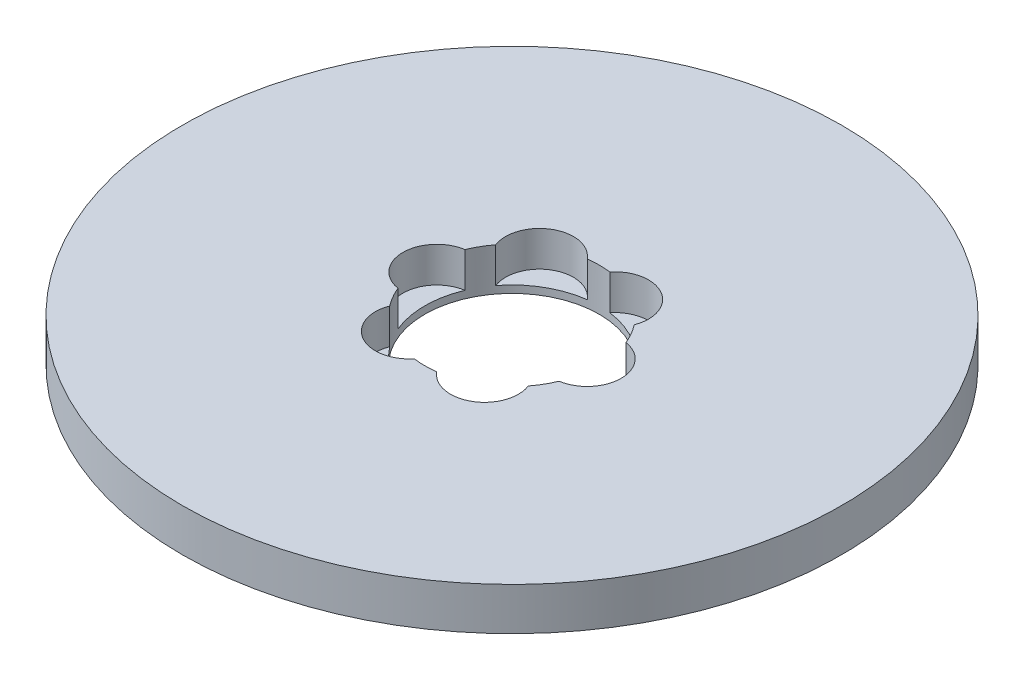
ISO-10303-21;
HEADER;
FILE_DESCRIPTION(('STEP AP214'),'2;1');
FILE_NAME('part.step','',(''),(''),'','','');
FILE_SCHEMA(('AUTOMOTIVE_DESIGN { 1 0 10303 214 1 1 1 1 }'));
ENDSEC;
DATA;
#1=APPLICATION_CONTEXT('core data for automotive mechanical design processes');
#2=APPLICATION_PROTOCOL_DEFINITION('international standard','automotive_design',2000,#1);
#3=PRODUCT_CONTEXT('',#1,'mechanical');
#4=PRODUCT('Part','Part','',(#3));
#5=PRODUCT_RELATED_PRODUCT_CATEGORY('part','',(#4));
#6=PRODUCT_DEFINITION_FORMATION('','',#4);
#7=PRODUCT_DEFINITION_CONTEXT('part definition',#1,'design');
#8=PRODUCT_DEFINITION('design','',#6,#7);
#9=PRODUCT_DEFINITION_SHAPE('','',#8);
#10=(LENGTH_UNIT() NAMED_UNIT(*) SI_UNIT(.MILLI.,.METRE.));
#11=(NAMED_UNIT(*) PLANE_ANGLE_UNIT() SI_UNIT($,.RADIAN.));
#12=(NAMED_UNIT(*) SI_UNIT($,.STERADIAN.) SOLID_ANGLE_UNIT());
#13=UNCERTAINTY_MEASURE_WITH_UNIT(LENGTH_MEASURE(1.E-05),#10,'distance_accuracy_value','');
#14=(GEOMETRIC_REPRESENTATION_CONTEXT(3) GLOBAL_UNCERTAINTY_ASSIGNED_CONTEXT((#13)) GLOBAL_UNIT_ASSIGNED_CONTEXT((#10,
#11,#12)) REPRESENTATION_CONTEXT('',''));
#15=CARTESIAN_POINT('',(0.,0.,0.));
#16=DIRECTION('',(0.,0.,1.));
#17=DIRECTION('',(1.,0.,0.));
#18=AXIS2_PLACEMENT_3D('',#15,#16,#17);
#19=CARTESIAN_POINT('',(0.,11.,0.));
#20=DIRECTION('',(0.,-1.,0.));
#21=DIRECTION('',(0.,0.,-1.));
#22=AXIS2_PLACEMENT_3D('',#19,#20,#21);
#23=CYLINDRICAL_SURFACE('',#22,85.);
#24=CARTESIAN_POINT('',(0.,11.,0.));
#25=DIRECTION('',(0.,1.,0.));
#26=DIRECTION('',(0.,0.,1.));
#27=AXIS2_PLACEMENT_3D('',#24,#25,#26);
#28=CIRCLE('',#27,85.);
#29=CARTESIAN_POINT('',(0.,11.,85.));
#30=VERTEX_POINT('',#29);
#31=EDGE_CURVE('E165',#30,#30,#28,.T.);
#32=ORIENTED_EDGE('',*,*,#31,.F.);
#33=EDGE_LOOP('',(#32));
#34=FACE_BOUND('',#33,.T.);
#35=CARTESIAN_POINT('',(0.,0.,0.));
#36=DIRECTION('',(0.,1.,0.));
#37=DIRECTION('',(0.,0.,1.));
#38=AXIS2_PLACEMENT_3D('',#35,#36,#37);
#39=CIRCLE('',#38,85.);
#40=CARTESIAN_POINT('',(0.,0.,85.));
#41=VERTEX_POINT('',#40);
#42=EDGE_CURVE('E158',#41,#41,#39,.T.);
#43=ORIENTED_EDGE('',*,*,#42,.T.);
#44=EDGE_LOOP('',(#43));
#45=FACE_BOUND('',#44,.T.);
#46=ADVANCED_FACE('F39',(#34,#45),#23,.T.);
#47=CARTESIAN_POINT('',(0.,11.,0.));
#48=DIRECTION('',(0.,1.,0.));
#49=DIRECTION('',(0.,0.,1.));
#50=AXIS2_PLACEMENT_3D('',#47,#48,#49);
#51=PLANE('',#50);
#52=CARTESIAN_POINT('',(19.3869676543309,11.,0.));
#53=DIRECTION('',(0.,1.,0.));
#54=DIRECTION('',(0.,0.,-1.));
#55=AXIS2_PLACEMENT_3D('',#52,#53,#54);
#56=CIRCLE('',#55,8.75356542556787);
#57=CARTESIAN_POINT('',(20.7737388727328,11.,8.64301875778998));
#58=VERTEX_POINT('',#57);
#59=CARTESIAN_POINT('',(20.7737388727328,11.,-8.64301875778998));
#60=VERTEX_POINT('',#59);
#61=EDGE_CURVE('E218',#58,#60,#56,.T.);
#62=ORIENTED_EDGE('',*,*,#61,.F.);
#63=CARTESIAN_POINT('',(0.,11.,0.));
#64=DIRECTION('',(0.,1.,0.));
#65=DIRECTION('',(0.,0.,1.));
#66=AXIS2_PLACEMENT_3D('',#63,#64,#65);
#67=CIRCLE('',#66,22.5);
#68=CARTESIAN_POINT('',(17.871943245998,11.,13.6690762164759));
#69=VERTEX_POINT('',#68);
#70=EDGE_CURVE('E163',#69,#58,#67,.T.);
#71=ORIENTED_EDGE('',*,*,#70,.F.);
#72=CARTESIAN_POINT('',(9.69348382716555,11.,16.7896064909978));
#73=DIRECTION('',(0.,1.,0.));
#74=DIRECTION('',(0.866025403784436,0.,-0.500000000000004));
#75=AXIS2_PLACEMENT_3D('',#72,#73,#74);
#76=CIRCLE('',#75,8.75356542556787);
#77=CARTESIAN_POINT('',(2.90179562673497,11.,22.3120949742659));
#78=VERTEX_POINT('',#77);
#79=EDGE_CURVE('E391',#78,#69,#76,.T.);
#80=ORIENTED_EDGE('',*,*,#79,.F.);
#81=CARTESIAN_POINT('',(-2.90179562673482,11.,22.3120949742659));
#82=VERTEX_POINT('',#81);
#83=EDGE_CURVE('E149',#82,#78,#67,.T.);
#84=ORIENTED_EDGE('',*,*,#83,.F.);
#85=CARTESIAN_POINT('',(-9.69348382716543,11.,16.7896064909978));
#86=DIRECTION('',(0.,1.,0.));
#87=DIRECTION('',(0.86602540378444,0.,0.499999999999998));
#88=AXIS2_PLACEMENT_3D('',#85,#86,#87);
#89=CIRCLE('',#88,8.75356542556787);
#90=CARTESIAN_POINT('',(-17.8719432459979,11.,13.669076216476));
#91=VERTEX_POINT('',#90);
#92=EDGE_CURVE('E128',#91,#82,#89,.T.);
#93=ORIENTED_EDGE('',*,*,#92,.F.);
#94=CARTESIAN_POINT('',(-20.7737388727328,11.,8.64301875778998));
#95=VERTEX_POINT('',#94);
#96=EDGE_CURVE('E148',#95,#91,#67,.T.);
#97=ORIENTED_EDGE('',*,*,#96,.F.);
#98=CARTESIAN_POINT('',(-19.3869676543309,11.,0.));
#99=DIRECTION('',(0.,1.,0.));
#100=DIRECTION('',(0.,0.,1.));
#101=AXIS2_PLACEMENT_3D('',#98,#99,#100);
#102=CIRCLE('',#101,8.75356542556787);
#103=CARTESIAN_POINT('',(-20.7737388727328,11.,-8.64301875778998));
#104=VERTEX_POINT('',#103);
#105=EDGE_CURVE('E178',#104,#95,#102,.T.);
#106=ORIENTED_EDGE('',*,*,#105,.F.);
#107=CARTESIAN_POINT('',(-17.8719432459981,11.,-13.6690762164757));
#108=VERTEX_POINT('',#107);
#109=EDGE_CURVE('E159',#108,#104,#67,.T.);
#110=ORIENTED_EDGE('',*,*,#109,.F.);
#111=CARTESIAN_POINT('',(-9.69348382716567,11.,-16.7896064909977));
#112=DIRECTION('',(0.,1.,0.));
#113=DIRECTION('',(-0.866025403784433,0.,0.50000000000001));
#114=AXIS2_PLACEMENT_3D('',#111,#112,#113);
#115=CIRCLE('',#114,8.75356542556787);
#116=CARTESIAN_POINT('',(-2.90179562673513,11.,-22.3120949742659));
#117=VERTEX_POINT('',#116);
#118=EDGE_CURVE('E376',#117,#108,#115,.T.);
#119=ORIENTED_EDGE('',*,*,#118,.F.);
#120=CARTESIAN_POINT('',(2.90179562673466,11.,-22.3120949742659));
#121=VERTEX_POINT('',#120);
#122=EDGE_CURVE('E170',#121,#117,#67,.T.);
#123=ORIENTED_EDGE('',*,*,#122,.F.);
#124=CARTESIAN_POINT('',(9.69348382716532,11.,-16.7896064909979));
#125=DIRECTION('',(0.,1.,0.));
#126=DIRECTION('',(-0.866025403784443,0.,-0.499999999999992));
#127=AXIS2_PLACEMENT_3D('',#124,#125,#126);
#128=CIRCLE('',#127,8.75356542556787);
#129=CARTESIAN_POINT('',(17.8719432459978,11.,-13.6690762164761));
#130=VERTEX_POINT('',#129);
#131=EDGE_CURVE('E384',#130,#121,#128,.T.);
#132=ORIENTED_EDGE('',*,*,#131,.F.);
#133=EDGE_CURVE('E173',#60,#130,#67,.T.);
#134=ORIENTED_EDGE('',*,*,#133,.F.);
#135=EDGE_LOOP('',(#62,#71,#80,#84,#93,#97,#106,#110,#119,#123,#132,#134));
#136=FACE_BOUND('',#135,.T.);
#137=ORIENTED_EDGE('',*,*,#31,.T.);
#138=EDGE_LOOP('',(#137));
#139=FACE_BOUND('',#138,.T.);
#140=ADVANCED_FACE('F141',(#136,#139),#51,.T.);
#141=CARTESIAN_POINT('',(0.,0.,0.));
#142=DIRECTION('',(0.,1.,0.));
#143=DIRECTION('',(0.,0.,1.));
#144=AXIS2_PLACEMENT_3D('',#141,#142,#143);
#145=PLANE('',#144);
#146=CARTESIAN_POINT('',(0.,0.,0.));
#147=DIRECTION('',(0.,1.,0.));
#148=DIRECTION('',(0.,0.,1.));
#149=AXIS2_PLACEMENT_3D('',#146,#147,#148);
#150=CIRCLE('',#149,22.5);
#151=CARTESIAN_POINT('',(0.,0.,22.5));
#152=VERTEX_POINT('',#151);
#153=EDGE_CURVE('E169',#152,#152,#150,.T.);
#154=ORIENTED_EDGE('',*,*,#153,.T.);
#155=EDGE_LOOP('',(#154));
#156=FACE_BOUND('',#155,.T.);
#157=ORIENTED_EDGE('',*,*,#42,.F.);
#158=EDGE_LOOP('',(#157));
#159=FACE_BOUND('',#158,.T.);
#160=ADVANCED_FACE('F236',(#156,#159),#145,.F.);
#161=CARTESIAN_POINT('',(0.,11.,0.));
#162=DIRECTION('',(0.,-1.,0.));
#163=DIRECTION('',(0.,0.,-1.));
#164=AXIS2_PLACEMENT_3D('',#161,#162,#163);
#165=CYLINDRICAL_SURFACE('',#164,22.5);
#166=DIRECTION('',(0.,1.,0.));
#167=VECTOR('',#166,1.);
#168=CARTESIAN_POINT('',(20.7737388727328,6.44738842506247,8.64301875778998));
#169=LINE('',#168,#167);
#170=CARTESIAN_POINT('',(20.7737388727328,1.89477685012495,8.64301875778998));
#171=VERTEX_POINT('',#170);
#172=EDGE_CURVE('E11',#171,#58,#169,.T.);
#173=ORIENTED_EDGE('',*,*,#172,.F.);
#174=CARTESIAN_POINT('',(0.,1.89477685012495,0.));
#175=DIRECTION('',(0.,1.,0.));
#176=DIRECTION('',(0.,0.,1.));
#177=AXIS2_PLACEMENT_3D('',#174,#175,#176);
#178=CIRCLE('',#177,22.5);
#179=CARTESIAN_POINT('',(20.7737388727328,1.89477685012495,-8.64301875778998));
#180=VERTEX_POINT('',#179);
#181=EDGE_CURVE('E212',#171,#180,#178,.T.);
#182=ORIENTED_EDGE('',*,*,#181,.T.);
#183=DIRECTION('',(0.,1.,0.));
#184=VECTOR('',#183,1.);
#185=CARTESIAN_POINT('',(20.7737388727328,6.44738842506247,-8.64301875778998));
#186=LINE('',#185,#184);
#187=EDGE_CURVE('E46',#60,#180,#186,.F.);
#188=ORIENTED_EDGE('',*,*,#187,.F.);
#189=ORIENTED_EDGE('',*,*,#133,.T.);
#190=DIRECTION('',(0.,1.,0.));
#191=VECTOR('',#190,1.);
#192=CARTESIAN_POINT('',(17.8719432459978,6.44738842506247,-13.6690762164761));
#193=LINE('',#192,#191);
#194=CARTESIAN_POINT('',(17.8719432459978,1.89477685012495,-13.6690762164761));
#195=VERTEX_POINT('',#194);
#196=EDGE_CURVE('E202',#195,#130,#193,.T.);
#197=ORIENTED_EDGE('',*,*,#196,.F.);
#198=CARTESIAN_POINT('',(0.,1.89477685012495,0.));
#199=DIRECTION('',(0.,1.,0.));
#200=DIRECTION('',(0.,0.,1.));
#201=AXIS2_PLACEMENT_3D('',#198,#199,#200);
#202=CIRCLE('',#201,22.5);
#203=CARTESIAN_POINT('',(2.90179562673466,1.89477685012495,-22.3120949742659));
#204=VERTEX_POINT('',#203);
#205=EDGE_CURVE('E200',#195,#204,#202,.T.);
#206=ORIENTED_EDGE('',*,*,#205,.T.);
#207=DIRECTION('',(0.,1.,0.));
#208=VECTOR('',#207,1.);
#209=CARTESIAN_POINT('',(2.90179562673466,6.44738842506247,-22.3120949742659));
#210=LINE('',#209,#208);
#211=EDGE_CURVE('E205',#121,#204,#210,.F.);
#212=ORIENTED_EDGE('',*,*,#211,.F.);
#213=ORIENTED_EDGE('',*,*,#122,.T.);
#214=DIRECTION('',(0.,1.,0.));
#215=VECTOR('',#214,1.);
#216=CARTESIAN_POINT('',(-2.90179562673513,6.44738842506247,-22.3120949742659));
#217=LINE('',#216,#215);
#218=CARTESIAN_POINT('',(-2.90179562673513,1.89477685012495,-22.3120949742659));
#219=VERTEX_POINT('',#218);
#220=EDGE_CURVE('E197',#219,#117,#217,.T.);
#221=ORIENTED_EDGE('',*,*,#220,.F.);
#222=CARTESIAN_POINT('',(0.,1.89477685012495,0.));
#223=DIRECTION('',(0.,1.,0.));
#224=DIRECTION('',(0.,0.,1.));
#225=AXIS2_PLACEMENT_3D('',#222,#223,#224);
#226=CIRCLE('',#225,22.5);
#227=CARTESIAN_POINT('',(-17.8719432459981,1.89477685012495,-13.6690762164757));
#228=VERTEX_POINT('',#227);
#229=EDGE_CURVE('E136',#219,#228,#226,.T.);
#230=ORIENTED_EDGE('',*,*,#229,.T.);
#231=DIRECTION('',(0.,1.,0.));
#232=VECTOR('',#231,1.);
#233=CARTESIAN_POINT('',(-17.8719432459981,6.44738842506247,-13.6690762164757));
#234=LINE('',#233,#232);
#235=EDGE_CURVE('E193',#108,#228,#234,.F.);
#236=ORIENTED_EDGE('',*,*,#235,.F.);
#237=ORIENTED_EDGE('',*,*,#109,.T.);
#238=DIRECTION('',(0.,1.,0.));
#239=VECTOR('',#238,1.);
#240=CARTESIAN_POINT('',(-20.7737388727328,6.44738842506247,-8.64301875778998));
#241=LINE('',#240,#239);
#242=CARTESIAN_POINT('',(-20.7737388727328,1.89477685012495,-8.64301875778998));
#243=VERTEX_POINT('',#242);
#244=EDGE_CURVE('E190',#243,#104,#241,.T.);
#245=ORIENTED_EDGE('',*,*,#244,.F.);
#246=CARTESIAN_POINT('',(0.,1.89477685012495,0.));
#247=DIRECTION('',(0.,1.,0.));
#248=DIRECTION('',(0.,0.,1.));
#249=AXIS2_PLACEMENT_3D('',#246,#247,#248);
#250=CIRCLE('',#249,22.5);
#251=CARTESIAN_POINT('',(-20.7737388727328,1.89477685012495,8.64301875778998));
#252=VERTEX_POINT('',#251);
#253=EDGE_CURVE('E181',#243,#252,#250,.T.);
#254=ORIENTED_EDGE('',*,*,#253,.T.);
#255=DIRECTION('',(0.,1.,0.));
#256=VECTOR('',#255,1.);
#257=CARTESIAN_POINT('',(-20.7737388727328,6.44738842506247,8.64301875778998));
#258=LINE('',#257,#256);
#259=EDGE_CURVE('E160',#95,#252,#258,.F.);
#260=ORIENTED_EDGE('',*,*,#259,.F.);
#261=ORIENTED_EDGE('',*,*,#96,.T.);
#262=DIRECTION('',(0.,1.,0.));
#263=VECTOR('',#262,1.);
#264=CARTESIAN_POINT('',(-17.8719432459979,6.44738842506247,13.669076216476));
#265=LINE('',#264,#263);
#266=CARTESIAN_POINT('',(-17.8719432459979,1.89477685012495,13.669076216476));
#267=VERTEX_POINT('',#266);
#268=EDGE_CURVE('E127',#267,#91,#265,.T.);
#269=ORIENTED_EDGE('',*,*,#268,.F.);
#270=CARTESIAN_POINT('',(0.,1.89477685012495,0.));
#271=DIRECTION('',(0.,1.,0.));
#272=DIRECTION('',(0.,0.,1.));
#273=AXIS2_PLACEMENT_3D('',#270,#271,#272);
#274=CIRCLE('',#273,22.5);
#275=CARTESIAN_POINT('',(-2.90179562673482,1.89477685012495,22.3120949742659));
#276=VERTEX_POINT('',#275);
#277=EDGE_CURVE('E188',#267,#276,#274,.T.);
#278=ORIENTED_EDGE('',*,*,#277,.T.);
#279=DIRECTION('',(0.,1.,0.));
#280=VECTOR('',#279,1.);
#281=CARTESIAN_POINT('',(-2.90179562673482,6.44738842506247,22.3120949742659));
#282=LINE('',#281,#280);
#283=EDGE_CURVE('E140',#82,#276,#282,.F.);
#284=ORIENTED_EDGE('',*,*,#283,.F.);
#285=ORIENTED_EDGE('',*,*,#83,.T.);
#286=DIRECTION('',(0.,1.,0.));
#287=VECTOR('',#286,1.);
#288=CARTESIAN_POINT('',(2.90179562673497,6.44738842506247,22.3120949742659));
#289=LINE('',#288,#287);
#290=CARTESIAN_POINT('',(2.90179562673497,1.89477685012495,22.3120949742659));
#291=VERTEX_POINT('',#290);
#292=EDGE_CURVE('E215',#291,#78,#289,.T.);
#293=ORIENTED_EDGE('',*,*,#292,.F.);
#294=CARTESIAN_POINT('',(0.,1.89477685012495,0.));
#295=DIRECTION('',(0.,1.,0.));
#296=DIRECTION('',(0.,0.,1.));
#297=AXIS2_PLACEMENT_3D('',#294,#295,#296);
#298=CIRCLE('',#297,22.5);
#299=CARTESIAN_POINT('',(17.871943245998,1.89477685012495,13.6690762164759));
#300=VERTEX_POINT('',#299);
#301=EDGE_CURVE('E210',#291,#300,#298,.T.);
#302=ORIENTED_EDGE('',*,*,#301,.T.);
#303=DIRECTION('',(0.,1.,0.));
#304=VECTOR('',#303,1.);
#305=CARTESIAN_POINT('',(17.871943245998,6.44738842506247,13.6690762164759));
#306=LINE('',#305,#304);
#307=EDGE_CURVE('E209',#69,#300,#306,.F.);
#308=ORIENTED_EDGE('',*,*,#307,.F.);
#309=ORIENTED_EDGE('',*,*,#70,.T.);
#310=EDGE_LOOP('',(#173,#182,#188,#189,#197,#206,#212,#213,#221,#230,#236,#237,#245,#254,#260,
#261,#269,#278,#284,#285,#293,#302,#308,#309));
#311=FACE_BOUND('',#310,.T.);
#312=ORIENTED_EDGE('',*,*,#153,.F.);
#313=EDGE_LOOP('',(#312));
#314=FACE_BOUND('',#313,.T.);
#315=ADVANCED_FACE('F153',(#311,#314),#165,.F.);
#316=CARTESIAN_POINT('',(-19.3869676543309,1.89477685012495,0.));
#317=DIRECTION('',(0.,1.,0.));
#318=DIRECTION('',(0.,0.,1.));
#319=AXIS2_PLACEMENT_3D('',#316,#317,#318);
#320=CYLINDRICAL_SURFACE('',#319,8.75356542556787);
#321=ORIENTED_EDGE('',*,*,#244,.T.);
#322=ORIENTED_EDGE('',*,*,#105,.T.);
#323=ORIENTED_EDGE('',*,*,#259,.T.);
#324=CARTESIAN_POINT('',(-19.3869676543309,1.89477685012495,0.));
#325=DIRECTION('',(0.,1.,0.));
#326=DIRECTION('',(0.,0.,1.));
#327=AXIS2_PLACEMENT_3D('',#324,#325,#326);
#328=CIRCLE('',#327,8.75356542556787);
#329=EDGE_CURVE('E176',#243,#252,#328,.T.);
#330=ORIENTED_EDGE('',*,*,#329,.F.);
#331=EDGE_LOOP('',(#321,#322,#323,#330));
#332=FACE_BOUND('',#331,.T.);
#333=ADVANCED_FACE('F247',(#332),#320,.F.);
#334=CARTESIAN_POINT('',(-19.3869676543309,1.89477685012495,0.));
#335=DIRECTION('',(0.,1.,0.));
#336=DIRECTION('',(0.,0.,1.));
#337=AXIS2_PLACEMENT_3D('',#334,#335,#336);
#338=PLANE('',#337);
#339=ORIENTED_EDGE('',*,*,#329,.T.);
#340=ORIENTED_EDGE('',*,*,#253,.F.);
#341=EDGE_LOOP('',(#339,#340));
#342=FACE_BOUND('',#341,.T.);
#343=ADVANCED_FACE('F252',(#342),#338,.T.);
#344=CARTESIAN_POINT('',(-9.69348382716543,1.89477685012495,16.7896064909978));
#345=DIRECTION('',(0.,1.,0.));
#346=DIRECTION('',(0.,0.,1.));
#347=AXIS2_PLACEMENT_3D('',#344,#345,#346);
#348=CYLINDRICAL_SURFACE('',#347,8.75356542556787);
#349=ORIENTED_EDGE('',*,*,#268,.T.);
#350=ORIENTED_EDGE('',*,*,#92,.T.);
#351=ORIENTED_EDGE('',*,*,#283,.T.);
#352=CARTESIAN_POINT('',(-9.69348382716543,1.89477685012495,16.7896064909978));
#353=DIRECTION('',(0.,1.,0.));
#354=DIRECTION('',(0.86602540378444,0.,0.499999999999998));
#355=AXIS2_PLACEMENT_3D('',#352,#353,#354);
#356=CIRCLE('',#355,8.75356542556787);
#357=EDGE_CURVE('E135',#267,#276,#356,.T.);
#358=ORIENTED_EDGE('',*,*,#357,.F.);
#359=EDGE_LOOP('',(#349,#350,#351,#358));
#360=FACE_BOUND('',#359,.T.);
#361=ADVANCED_FACE('F126',(#360),#348,.F.);
#362=CARTESIAN_POINT('',(-9.69348382716543,1.89477685012495,16.7896064909978));
#363=DIRECTION('',(0.,1.,0.));
#364=DIRECTION('',(0.86602540378444,0.,0.499999999999998));
#365=AXIS2_PLACEMENT_3D('',#362,#363,#364);
#366=PLANE('',#365);
#367=ORIENTED_EDGE('',*,*,#357,.T.);
#368=ORIENTED_EDGE('',*,*,#277,.F.);
#369=EDGE_LOOP('',(#367,#368));
#370=FACE_BOUND('',#369,.T.);
#371=ADVANCED_FACE('F259',(#370),#366,.T.);
#372=CARTESIAN_POINT('',(-9.69348382716567,1.89477685012495,-16.7896064909977));
#373=DIRECTION('',(0.,1.,0.));
#374=DIRECTION('',(0.,0.,1.));
#375=AXIS2_PLACEMENT_3D('',#372,#373,#374);
#376=CYLINDRICAL_SURFACE('',#375,8.75356542556787);
#377=ORIENTED_EDGE('',*,*,#220,.T.);
#378=ORIENTED_EDGE('',*,*,#118,.T.);
#379=ORIENTED_EDGE('',*,*,#235,.T.);
#380=CARTESIAN_POINT('',(-9.69348382716567,1.89477685012495,-16.7896064909977));
#381=DIRECTION('',(0.,1.,0.));
#382=DIRECTION('',(-0.866025403784433,0.,0.50000000000001));
#383=AXIS2_PLACEMENT_3D('',#380,#381,#382);
#384=CIRCLE('',#383,8.75356542556787);
#385=EDGE_CURVE('E380',#219,#228,#384,.T.);
#386=ORIENTED_EDGE('',*,*,#385,.F.);
#387=EDGE_LOOP('',(#377,#378,#379,#386));
#388=FACE_BOUND('',#387,.T.);
#389=ADVANCED_FACE('F265',(#388),#376,.F.);
#390=CARTESIAN_POINT('',(-9.69348382716567,1.89477685012495,-16.7896064909977));
#391=DIRECTION('',(0.,1.,0.));
#392=DIRECTION('',(-0.866025403784433,0.,0.50000000000001));
#393=AXIS2_PLACEMENT_3D('',#390,#391,#392);
#394=PLANE('',#393);
#395=ORIENTED_EDGE('',*,*,#385,.T.);
#396=ORIENTED_EDGE('',*,*,#229,.F.);
#397=EDGE_LOOP('',(#395,#396));
#398=FACE_BOUND('',#397,.T.);
#399=ADVANCED_FACE('F308',(#398),#394,.T.);
#400=CARTESIAN_POINT('',(9.69348382716532,1.89477685012495,-16.7896064909979));
#401=DIRECTION('',(0.,1.,0.));
#402=DIRECTION('',(0.,0.,1.));
#403=AXIS2_PLACEMENT_3D('',#400,#401,#402);
#404=CYLINDRICAL_SURFACE('',#403,8.75356542556787);
#405=ORIENTED_EDGE('',*,*,#196,.T.);
#406=ORIENTED_EDGE('',*,*,#131,.T.);
#407=ORIENTED_EDGE('',*,*,#211,.T.);
#408=CARTESIAN_POINT('',(9.69348382716532,1.89477685012495,-16.7896064909979));
#409=DIRECTION('',(0.,1.,0.));
#410=DIRECTION('',(-0.866025403784443,0.,-0.499999999999992));
#411=AXIS2_PLACEMENT_3D('',#408,#409,#410);
#412=CIRCLE('',#411,8.75356542556787);
#413=EDGE_CURVE('E383',#195,#204,#412,.T.);
#414=ORIENTED_EDGE('',*,*,#413,.F.);
#415=EDGE_LOOP('',(#405,#406,#407,#414));
#416=FACE_BOUND('',#415,.T.);
#417=ADVANCED_FACE('F300',(#416),#404,.F.);
#418=CARTESIAN_POINT('',(9.69348382716532,1.89477685012495,-16.7896064909979));
#419=DIRECTION('',(0.,1.,0.));
#420=DIRECTION('',(-0.866025403784443,0.,-0.499999999999992));
#421=AXIS2_PLACEMENT_3D('',#418,#419,#420);
#422=PLANE('',#421);
#423=ORIENTED_EDGE('',*,*,#413,.T.);
#424=ORIENTED_EDGE('',*,*,#205,.F.);
#425=EDGE_LOOP('',(#423,#424));
#426=FACE_BOUND('',#425,.T.);
#427=ADVANCED_FACE('F270',(#426),#422,.T.);
#428=CARTESIAN_POINT('',(9.69348382716555,1.89477685012495,16.7896064909978));
#429=DIRECTION('',(0.,1.,0.));
#430=DIRECTION('',(0.,0.,1.));
#431=AXIS2_PLACEMENT_3D('',#428,#429,#430);
#432=CYLINDRICAL_SURFACE('',#431,8.75356542556787);
#433=ORIENTED_EDGE('',*,*,#292,.T.);
#434=ORIENTED_EDGE('',*,*,#79,.T.);
#435=ORIENTED_EDGE('',*,*,#307,.T.);
#436=CARTESIAN_POINT('',(9.69348382716555,1.89477685012495,16.7896064909978));
#437=DIRECTION('',(0.,1.,0.));
#438=DIRECTION('',(0.866025403784436,0.,-0.500000000000004));
#439=AXIS2_PLACEMENT_3D('',#436,#437,#438);
#440=CIRCLE('',#439,8.75356542556787);
#441=EDGE_CURVE('E56',#291,#300,#440,.T.);
#442=ORIENTED_EDGE('',*,*,#441,.F.);
#443=EDGE_LOOP('',(#433,#434,#435,#442));
#444=FACE_BOUND('',#443,.T.);
#445=ADVANCED_FACE('F262',(#444),#432,.F.);
#446=CARTESIAN_POINT('',(9.69348382716555,1.89477685012495,16.7896064909978));
#447=DIRECTION('',(0.,1.,0.));
#448=DIRECTION('',(0.866025403784436,0.,-0.500000000000004));
#449=AXIS2_PLACEMENT_3D('',#446,#447,#448);
#450=PLANE('',#449);
#451=ORIENTED_EDGE('',*,*,#441,.T.);
#452=ORIENTED_EDGE('',*,*,#301,.F.);
#453=EDGE_LOOP('',(#451,#452));
#454=FACE_BOUND('',#453,.T.);
#455=ADVANCED_FACE('F228',(#454),#450,.T.);
#456=CARTESIAN_POINT('',(19.3869676543309,1.89477685012495,0.));
#457=DIRECTION('',(0.,1.,0.));
#458=DIRECTION('',(0.,0.,1.));
#459=AXIS2_PLACEMENT_3D('',#456,#457,#458);
#460=CYLINDRICAL_SURFACE('',#459,8.75356542556787);
#461=ORIENTED_EDGE('',*,*,#172,.T.);
#462=ORIENTED_EDGE('',*,*,#61,.T.);
#463=ORIENTED_EDGE('',*,*,#187,.T.);
#464=CARTESIAN_POINT('',(19.3869676543309,1.89477685012495,0.));
#465=DIRECTION('',(0.,1.,0.));
#466=DIRECTION('',(0.,0.,-1.));
#467=AXIS2_PLACEMENT_3D('',#464,#465,#466);
#468=CIRCLE('',#467,8.75356542556787);
#469=EDGE_CURVE('E55',#171,#180,#468,.T.);
#470=ORIENTED_EDGE('',*,*,#469,.F.);
#471=EDGE_LOOP('',(#461,#462,#463,#470));
#472=FACE_BOUND('',#471,.T.);
#473=ADVANCED_FACE('F217',(#472),#460,.F.);
#474=CARTESIAN_POINT('',(19.3869676543309,1.89477685012495,0.));
#475=DIRECTION('',(0.,1.,0.));
#476=DIRECTION('',(0.,0.,-1.));
#477=AXIS2_PLACEMENT_3D('',#474,#475,#476);
#478=PLANE('',#477);
#479=ORIENTED_EDGE('',*,*,#469,.T.);
#480=ORIENTED_EDGE('',*,*,#181,.F.);
#481=EDGE_LOOP('',(#479,#480));
#482=FACE_BOUND('',#481,.T.);
#483=ADVANCED_FACE('F224',(#482),#478,.T.);
#484=CLOSED_SHELL('',(#46,#140,#160,#315,#333,#343,#361,#371,#389,#399,#417,#427,#445,#455,#473,#483));
#485=MANIFOLD_SOLID_BREP('B2',#484);
#486=ADVANCED_BREP_SHAPE_REPRESENTATION('',(#18,#485),#14);
#487=SHAPE_DEFINITION_REPRESENTATION(#9,#486);
ENDSEC;
END-ISO-10303-21;
